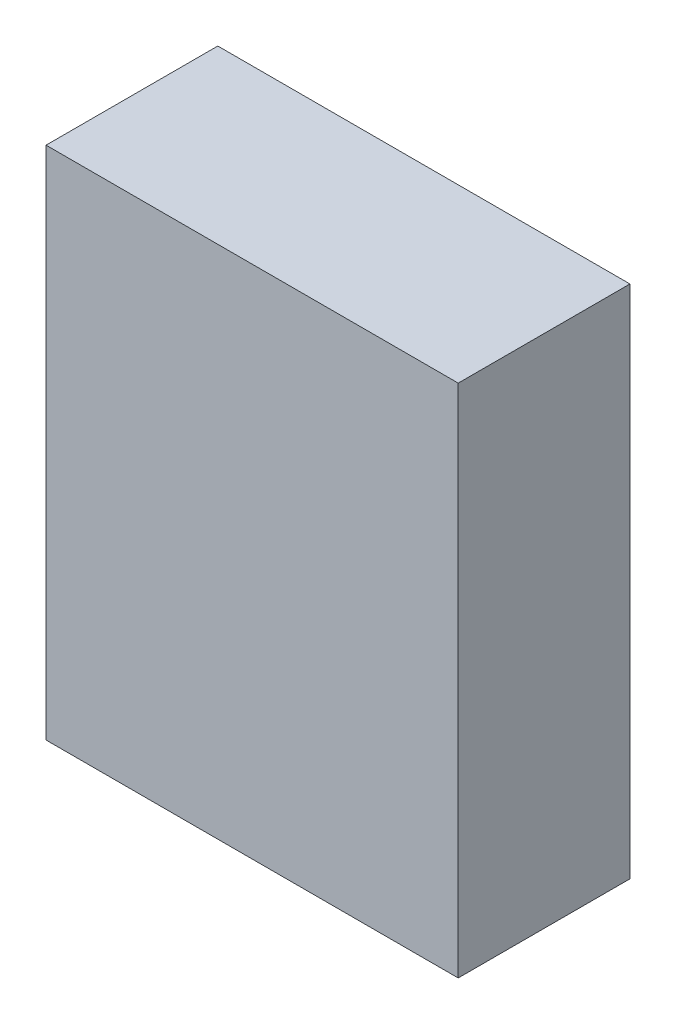
ISO-10303-21;
HEADER;
FILE_DESCRIPTION(('STEP AP214'),'2;1');
FILE_NAME('part.step','',(''),(''),'','','');
FILE_SCHEMA(('AUTOMOTIVE_DESIGN { 1 0 10303 214 1 1 1 1 }'));
ENDSEC;
DATA;
#1=APPLICATION_CONTEXT('core data for automotive mechanical design processes');
#2=APPLICATION_PROTOCOL_DEFINITION('international standard','automotive_design',2000,#1);
#3=PRODUCT_CONTEXT('',#1,'mechanical');
#4=PRODUCT('Part','Part','',(#3));
#5=PRODUCT_RELATED_PRODUCT_CATEGORY('part','',(#4));
#6=PRODUCT_DEFINITION_FORMATION('','',#4);
#7=PRODUCT_DEFINITION_CONTEXT('part definition',#1,'design');
#8=PRODUCT_DEFINITION('design','',#6,#7);
#9=PRODUCT_DEFINITION_SHAPE('','',#8);
#10=(LENGTH_UNIT() NAMED_UNIT(*) SI_UNIT(.MILLI.,.METRE.));
#11=(NAMED_UNIT(*) PLANE_ANGLE_UNIT() SI_UNIT($,.RADIAN.));
#12=(NAMED_UNIT(*) SI_UNIT($,.STERADIAN.) SOLID_ANGLE_UNIT());
#13=UNCERTAINTY_MEASURE_WITH_UNIT(LENGTH_MEASURE(1.E-05),#10,'distance_accuracy_value','');
#14=(GEOMETRIC_REPRESENTATION_CONTEXT(3) GLOBAL_UNCERTAINTY_ASSIGNED_CONTEXT((#13)) GLOBAL_UNIT_ASSIGNED_CONTEXT((#10,
#11,#12)) REPRESENTATION_CONTEXT('',''));
#15=CARTESIAN_POINT('',(0.,0.,0.));
#16=DIRECTION('',(0.,0.,1.));
#17=DIRECTION('',(1.,0.,0.));
#18=AXIS2_PLACEMENT_3D('',#15,#16,#17);
#19=CARTESIAN_POINT('',(30.,37.5,25.));
#20=DIRECTION('',(-1.,0.,0.));
#21=DIRECTION('',(0.,0.,1.));
#22=AXIS2_PLACEMENT_3D('',#19,#20,#21);
#23=PLANE('',#22);
#24=DIRECTION('',(0.,1.,0.));
#25=VECTOR('',#24,1.);
#26=CARTESIAN_POINT('',(30.,37.5,0.));
#27=LINE('',#26,#25);
#28=CARTESIAN_POINT('',(30.,-37.5,0.));
#29=VERTEX_POINT('',#28);
#30=CARTESIAN_POINT('',(30.,37.5,0.));
#31=VERTEX_POINT('',#30);
#32=EDGE_CURVE('E107',#29,#31,#27,.T.);
#33=ORIENTED_EDGE('',*,*,#32,.T.);
#34=DIRECTION('',(0.,0.,-1.));
#35=VECTOR('',#34,1.);
#36=CARTESIAN_POINT('',(30.,37.5,25.));
#37=LINE('',#36,#35);
#38=CARTESIAN_POINT('',(30.,37.5,25.));
#39=VERTEX_POINT('',#38);
#40=EDGE_CURVE('E11',#39,#31,#37,.T.);
#41=ORIENTED_EDGE('',*,*,#40,.F.);
#42=DIRECTION('',(0.,1.,0.));
#43=VECTOR('',#42,1.);
#44=CARTESIAN_POINT('',(30.,37.5,25.));
#45=LINE('',#44,#43);
#46=CARTESIAN_POINT('',(30.,-37.5,25.));
#47=VERTEX_POINT('',#46);
#48=EDGE_CURVE('E91',#47,#39,#45,.T.);
#49=ORIENTED_EDGE('',*,*,#48,.F.);
#50=DIRECTION('',(0.,0.,-1.));
#51=VECTOR('',#50,1.);
#52=CARTESIAN_POINT('',(30.,-37.5,25.));
#53=LINE('',#52,#51);
#54=EDGE_CURVE('E103',#47,#29,#53,.T.);
#55=ORIENTED_EDGE('',*,*,#54,.T.);
#56=EDGE_LOOP('',(#33,#41,#49,#55));
#57=FACE_BOUND('',#56,.T.);
#58=ADVANCED_FACE('F39',(#57),#23,.F.);
#59=CARTESIAN_POINT('',(-30.,37.5,25.));
#60=DIRECTION('',(0.,-1.,0.));
#61=DIRECTION('',(0.,0.,-1.));
#62=AXIS2_PLACEMENT_3D('',#59,#60,#61);
#63=PLANE('',#62);
#64=DIRECTION('',(-1.,0.,0.));
#65=VECTOR('',#64,1.);
#66=CARTESIAN_POINT('',(-30.,37.5,0.));
#67=LINE('',#66,#65);
#68=CARTESIAN_POINT('',(-30.,37.5,0.));
#69=VERTEX_POINT('',#68);
#70=EDGE_CURVE('E96',#31,#69,#67,.T.);
#71=ORIENTED_EDGE('',*,*,#70,.T.);
#72=DIRECTION('',(0.,0.,-1.));
#73=VECTOR('',#72,1.);
#74=CARTESIAN_POINT('',(-30.,37.5,25.));
#75=LINE('',#74,#73);
#76=CARTESIAN_POINT('',(-30.,37.5,25.));
#77=VERTEX_POINT('',#76);
#78=EDGE_CURVE('E48',#77,#69,#75,.T.);
#79=ORIENTED_EDGE('',*,*,#78,.F.);
#80=DIRECTION('',(-1.,0.,0.));
#81=VECTOR('',#80,1.);
#82=CARTESIAN_POINT('',(-30.,37.5,25.));
#83=LINE('',#82,#81);
#84=EDGE_CURVE('E86',#39,#77,#83,.T.);
#85=ORIENTED_EDGE('',*,*,#84,.F.);
#86=ORIENTED_EDGE('',*,*,#40,.T.);
#87=EDGE_LOOP('',(#71,#79,#85,#86));
#88=FACE_BOUND('',#87,.T.);
#89=ADVANCED_FACE('F95',(#88),#63,.F.);
#90=CARTESIAN_POINT('',(-30.,37.5,25.));
#91=DIRECTION('',(1.,0.,0.));
#92=DIRECTION('',(0.,0.,-1.));
#93=AXIS2_PLACEMENT_3D('',#90,#91,#92);
#94=PLANE('',#93);
#95=DIRECTION('',(0.,-1.,0.));
#96=VECTOR('',#95,1.);
#97=CARTESIAN_POINT('',(-30.,37.5,0.));
#98=LINE('',#97,#96);
#99=CARTESIAN_POINT('',(-30.,-37.5,0.));
#100=VERTEX_POINT('',#99);
#101=EDGE_CURVE('E73',#69,#100,#98,.T.);
#102=ORIENTED_EDGE('',*,*,#101,.T.);
#103=DIRECTION('',(0.,0.,-1.));
#104=VECTOR('',#103,1.);
#105=CARTESIAN_POINT('',(-30.,-37.5,25.));
#106=LINE('',#105,#104);
#107=CARTESIAN_POINT('',(-30.,-37.5,25.));
#108=VERTEX_POINT('',#107);
#109=EDGE_CURVE('E98',#108,#100,#106,.T.);
#110=ORIENTED_EDGE('',*,*,#109,.F.);
#111=DIRECTION('',(0.,-1.,0.));
#112=VECTOR('',#111,1.);
#113=CARTESIAN_POINT('',(-30.,37.5,25.));
#114=LINE('',#113,#112);
#115=EDGE_CURVE('E89',#77,#108,#114,.T.);
#116=ORIENTED_EDGE('',*,*,#115,.F.);
#117=ORIENTED_EDGE('',*,*,#78,.T.);
#118=EDGE_LOOP('',(#102,#110,#116,#117));
#119=FACE_BOUND('',#118,.T.);
#120=ADVANCED_FACE('F99',(#119),#94,.F.);
#121=CARTESIAN_POINT('',(-30.,-37.5,25.));
#122=DIRECTION('',(0.,1.,0.));
#123=DIRECTION('',(0.,0.,1.));
#124=AXIS2_PLACEMENT_3D('',#121,#122,#123);
#125=PLANE('',#124);
#126=DIRECTION('',(1.,0.,0.));
#127=VECTOR('',#126,1.);
#128=CARTESIAN_POINT('',(-30.,-37.5,0.));
#129=LINE('',#128,#127);
#130=EDGE_CURVE('E79',#100,#29,#129,.T.);
#131=ORIENTED_EDGE('',*,*,#130,.T.);
#132=ORIENTED_EDGE('',*,*,#54,.F.);
#133=DIRECTION('',(1.,0.,0.));
#134=VECTOR('',#133,1.);
#135=CARTESIAN_POINT('',(-30.,-37.5,25.));
#136=LINE('',#135,#134);
#137=EDGE_CURVE('E56',#108,#47,#136,.T.);
#138=ORIENTED_EDGE('',*,*,#137,.F.);
#139=ORIENTED_EDGE('',*,*,#109,.T.);
#140=EDGE_LOOP('',(#131,#132,#138,#139));
#141=FACE_BOUND('',#140,.T.);
#142=ADVANCED_FACE('F120',(#141),#125,.F.);
#143=CARTESIAN_POINT('',(0.,0.,25.));
#144=DIRECTION('',(0.,0.,1.));
#145=DIRECTION('',(1.,0.,0.));
#146=AXIS2_PLACEMENT_3D('',#143,#144,#145);
#147=PLANE('',#146);
#148=ORIENTED_EDGE('',*,*,#48,.T.);
#149=ORIENTED_EDGE('',*,*,#84,.T.);
#150=ORIENTED_EDGE('',*,*,#115,.T.);
#151=ORIENTED_EDGE('',*,*,#137,.T.);
#152=EDGE_LOOP('',(#148,#149,#150,#151));
#153=FACE_BOUND('',#152,.T.);
#154=ADVANCED_FACE('F87',(#153),#147,.T.);
#155=CARTESIAN_POINT('',(0.,0.,0.));
#156=DIRECTION('',(0.,0.,1.));
#157=DIRECTION('',(1.,0.,0.));
#158=AXIS2_PLACEMENT_3D('',#155,#156,#157);
#159=PLANE('',#158);
#160=ORIENTED_EDGE('',*,*,#32,.F.);
#161=ORIENTED_EDGE('',*,*,#130,.F.);
#162=ORIENTED_EDGE('',*,*,#101,.F.);
#163=ORIENTED_EDGE('',*,*,#70,.F.);
#164=EDGE_LOOP('',(#160,#161,#162,#163));
#165=FACE_BOUND('',#164,.T.);
#166=ADVANCED_FACE('F123',(#165),#159,.F.);
#167=CLOSED_SHELL('',(#58,#89,#120,#142,#154,#166));
#168=MANIFOLD_SOLID_BREP('B2',#167);
#169=ADVANCED_BREP_SHAPE_REPRESENTATION('',(#18,#168),#14);
#170=SHAPE_DEFINITION_REPRESENTATION(#9,#169);
ENDSEC;
END-ISO-10303-21;
